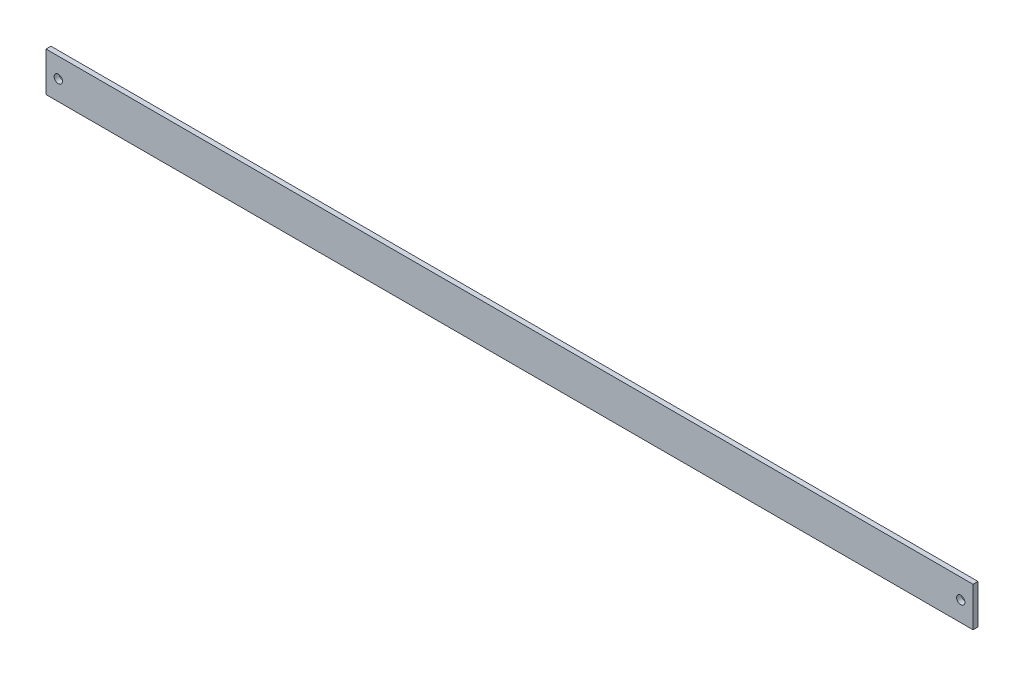
ISO-10303-21;
HEADER;
FILE_DESCRIPTION(('STEP AP214'),'2;1');
FILE_NAME('part.step','',(''),(''),'','','');
FILE_SCHEMA(('AUTOMOTIVE_DESIGN { 1 0 10303 214 1 1 1 1 }'));
ENDSEC;
DATA;
#1=APPLICATION_CONTEXT('core data for automotive mechanical design processes');
#2=APPLICATION_PROTOCOL_DEFINITION('international standard','automotive_design',2000,#1);
#3=PRODUCT_CONTEXT('',#1,'mechanical');
#4=PRODUCT('Part','Part','',(#3));
#5=PRODUCT_RELATED_PRODUCT_CATEGORY('part','',(#4));
#6=PRODUCT_DEFINITION_FORMATION('','',#4);
#7=PRODUCT_DEFINITION_CONTEXT('part definition',#1,'design');
#8=PRODUCT_DEFINITION('design','',#6,#7);
#9=PRODUCT_DEFINITION_SHAPE('','',#8);
#10=(LENGTH_UNIT() NAMED_UNIT(*) SI_UNIT(.MILLI.,.METRE.));
#11=(NAMED_UNIT(*) PLANE_ANGLE_UNIT() SI_UNIT($,.RADIAN.));
#12=(NAMED_UNIT(*) SI_UNIT($,.STERADIAN.) SOLID_ANGLE_UNIT());
#13=UNCERTAINTY_MEASURE_WITH_UNIT(LENGTH_MEASURE(1.E-05),#10,'distance_accuracy_value','');
#14=(GEOMETRIC_REPRESENTATION_CONTEXT(3) GLOBAL_UNCERTAINTY_ASSIGNED_CONTEXT((#13)) GLOBAL_UNIT_ASSIGNED_CONTEXT((#10,
#11,#12)) REPRESENTATION_CONTEXT('',''));
#15=CARTESIAN_POINT('',(0.,0.,0.));
#16=DIRECTION('',(0.,0.,1.));
#17=DIRECTION('',(1.,0.,0.));
#18=AXIS2_PLACEMENT_3D('',#15,#16,#17);
#19=CARTESIAN_POINT('',(596.9,0.,0.));
#20=DIRECTION('',(0.,0.,-1.));
#21=DIRECTION('',(-1.,0.,0.));
#22=AXIS2_PLACEMENT_3D('',#19,#20,#21);
#23=PLANE('',#22);
#24=CARTESIAN_POINT('',(7.93749999999999,12.7,0.));
#25=DIRECTION('',(0.,0.,1.));
#26=DIRECTION('',(1.,0.,0.));
#27=AXIS2_PLACEMENT_3D('',#24,#25,#26);
#28=CIRCLE('',#27,2.667);
#29=CARTESIAN_POINT('',(10.6045,12.7,0.));
#30=VERTEX_POINT('',#29);
#31=EDGE_CURVE('E112',#30,#30,#28,.T.);
#32=ORIENTED_EDGE('',*,*,#31,.F.);
#33=EDGE_LOOP('',(#32));
#34=FACE_BOUND('',#33,.T.);
#35=CARTESIAN_POINT('',(588.9625,12.7,0.));
#36=DIRECTION('',(0.,0.,1.));
#37=DIRECTION('',(1.,0.,0.));
#38=AXIS2_PLACEMENT_3D('',#35,#36,#37);
#39=CIRCLE('',#38,2.66700000000002);
#40=CARTESIAN_POINT('',(591.6295,12.7,0.));
#41=VERTEX_POINT('',#40);
#42=EDGE_CURVE('E113',#41,#41,#39,.T.);
#43=ORIENTED_EDGE('',*,*,#42,.F.);
#44=EDGE_LOOP('',(#43));
#45=FACE_BOUND('',#44,.T.);
#46=DIRECTION('',(0.,-1.,0.));
#47=VECTOR('',#46,1.);
#48=CARTESIAN_POINT('',(0.,0.,0.));
#49=LINE('',#48,#47);
#50=CARTESIAN_POINT('',(0.,25.4,0.));
#51=VERTEX_POINT('',#50);
#52=CARTESIAN_POINT('',(0.,0.,0.));
#53=VERTEX_POINT('',#52);
#54=EDGE_CURVE('E95',#51,#53,#49,.T.);
#55=ORIENTED_EDGE('',*,*,#54,.T.);
#56=DIRECTION('',(-1.,0.,0.));
#57=VECTOR('',#56,1.);
#58=CARTESIAN_POINT('',(596.9,0.,0.));
#59=LINE('',#58,#57);
#60=CARTESIAN_POINT('',(596.9,0.,0.));
#61=VERTEX_POINT('',#60);
#62=EDGE_CURVE('E11',#61,#53,#59,.T.);
#63=ORIENTED_EDGE('',*,*,#62,.F.);
#64=DIRECTION('',(0.,-1.,0.));
#65=VECTOR('',#64,1.);
#66=CARTESIAN_POINT('',(596.9,0.,0.));
#67=LINE('',#66,#65);
#68=CARTESIAN_POINT('',(596.9,25.4,0.));
#69=VERTEX_POINT('',#68);
#70=EDGE_CURVE('E83',#69,#61,#67,.T.);
#71=ORIENTED_EDGE('',*,*,#70,.F.);
#72=DIRECTION('',(-1.,0.,0.));
#73=VECTOR('',#72,1.);
#74=CARTESIAN_POINT('',(596.9,25.4,0.));
#75=LINE('',#74,#73);
#76=EDGE_CURVE('E91',#69,#51,#75,.T.);
#77=ORIENTED_EDGE('',*,*,#76,.T.);
#78=EDGE_LOOP('',(#55,#63,#71,#77));
#79=FACE_BOUND('',#78,.T.);
#80=ADVANCED_FACE('F32',(#34,#45,#79),#23,.F.);
#81=CARTESIAN_POINT('',(596.9,0.,0.));
#82=DIRECTION('',(0.,1.,0.));
#83=DIRECTION('',(0.,0.,1.));
#84=AXIS2_PLACEMENT_3D('',#81,#82,#83);
#85=PLANE('',#84);
#86=DIRECTION('',(0.,0.,-1.));
#87=VECTOR('',#86,1.);
#88=CARTESIAN_POINT('',(0.,0.,0.));
#89=LINE('',#88,#87);
#90=CARTESIAN_POINT('',(0.,0.,-3.175));
#91=VERTEX_POINT('',#90);
#92=EDGE_CURVE('E87',#53,#91,#89,.T.);
#93=ORIENTED_EDGE('',*,*,#92,.T.);
#94=DIRECTION('',(-1.,0.,0.));
#95=VECTOR('',#94,1.);
#96=CARTESIAN_POINT('',(596.9,0.,-3.175));
#97=LINE('',#96,#95);
#98=CARTESIAN_POINT('',(596.9,0.,-3.175));
#99=VERTEX_POINT('',#98);
#100=EDGE_CURVE('E40',#99,#91,#97,.T.);
#101=ORIENTED_EDGE('',*,*,#100,.F.);
#102=DIRECTION('',(0.,0.,-1.));
#103=VECTOR('',#102,1.);
#104=CARTESIAN_POINT('',(596.9,0.,0.));
#105=LINE('',#104,#103);
#106=EDGE_CURVE('E78',#61,#99,#105,.T.);
#107=ORIENTED_EDGE('',*,*,#106,.F.);
#108=ORIENTED_EDGE('',*,*,#62,.T.);
#109=EDGE_LOOP('',(#93,#101,#107,#108));
#110=FACE_BOUND('',#109,.T.);
#111=ADVANCED_FACE('F86',(#110),#85,.F.);
#112=CARTESIAN_POINT('',(596.9,0.,-3.175));
#113=DIRECTION('',(0.,0.,1.));
#114=DIRECTION('',(1.,0.,0.));
#115=AXIS2_PLACEMENT_3D('',#112,#113,#114);
#116=PLANE('',#115);
#117=CARTESIAN_POINT('',(7.93749999999999,12.7,-3.175));
#118=DIRECTION('',(0.,0.,1.));
#119=DIRECTION('',(1.,0.,0.));
#120=AXIS2_PLACEMENT_3D('',#117,#118,#119);
#121=CIRCLE('',#120,2.667);
#122=CARTESIAN_POINT('',(10.6045,12.7,-3.175));
#123=VERTEX_POINT('',#122);
#124=EDGE_CURVE('E98',#123,#123,#121,.F.);
#125=ORIENTED_EDGE('',*,*,#124,.F.);
#126=EDGE_LOOP('',(#125));
#127=FACE_BOUND('',#126,.T.);
#128=CARTESIAN_POINT('',(588.9625,12.7,-3.175));
#129=DIRECTION('',(0.,0.,1.));
#130=DIRECTION('',(1.,0.,0.));
#131=AXIS2_PLACEMENT_3D('',#128,#129,#130);
#132=CIRCLE('',#131,2.66700000000002);
#133=CARTESIAN_POINT('',(591.6295,12.7,-3.175));
#134=VERTEX_POINT('',#133);
#135=EDGE_CURVE('E109',#134,#134,#132,.F.);
#136=ORIENTED_EDGE('',*,*,#135,.F.);
#137=EDGE_LOOP('',(#136));
#138=FACE_BOUND('',#137,.T.);
#139=DIRECTION('',(0.,1.,0.));
#140=VECTOR('',#139,1.);
#141=CARTESIAN_POINT('',(0.,0.,-3.175));
#142=LINE('',#141,#140);
#143=CARTESIAN_POINT('',(0.,25.4,-3.175));
#144=VERTEX_POINT('',#143);
#145=EDGE_CURVE('E65',#91,#144,#142,.T.);
#146=ORIENTED_EDGE('',*,*,#145,.T.);
#147=DIRECTION('',(-1.,0.,0.));
#148=VECTOR('',#147,1.);
#149=CARTESIAN_POINT('',(596.9,25.4,-3.175));
#150=LINE('',#149,#148);
#151=CARTESIAN_POINT('',(596.9,25.4,-3.175));
#152=VERTEX_POINT('',#151);
#153=EDGE_CURVE('E88',#152,#144,#150,.T.);
#154=ORIENTED_EDGE('',*,*,#153,.F.);
#155=DIRECTION('',(0.,1.,0.));
#156=VECTOR('',#155,1.);
#157=CARTESIAN_POINT('',(596.9,0.,-3.175));
#158=LINE('',#157,#156);
#159=EDGE_CURVE('E81',#99,#152,#158,.T.);
#160=ORIENTED_EDGE('',*,*,#159,.F.);
#161=ORIENTED_EDGE('',*,*,#100,.T.);
#162=EDGE_LOOP('',(#146,#154,#160,#161));
#163=FACE_BOUND('',#162,.T.);
#164=ADVANCED_FACE('F89',(#127,#138,#163),#116,.F.);
#165=CARTESIAN_POINT('',(596.9,25.4,0.));
#166=DIRECTION('',(0.,-1.,0.));
#167=DIRECTION('',(0.,0.,-1.));
#168=AXIS2_PLACEMENT_3D('',#165,#166,#167);
#169=PLANE('',#168);
#170=DIRECTION('',(0.,0.,1.));
#171=VECTOR('',#170,1.);
#172=CARTESIAN_POINT('',(0.,25.4,0.));
#173=LINE('',#172,#171);
#174=EDGE_CURVE('E71',#144,#51,#173,.T.);
#175=ORIENTED_EDGE('',*,*,#174,.T.);
#176=ORIENTED_EDGE('',*,*,#76,.F.);
#177=DIRECTION('',(0.,0.,1.));
#178=VECTOR('',#177,1.);
#179=CARTESIAN_POINT('',(596.9,25.4,0.));
#180=LINE('',#179,#178);
#181=EDGE_CURVE('E48',#152,#69,#180,.T.);
#182=ORIENTED_EDGE('',*,*,#181,.F.);
#183=ORIENTED_EDGE('',*,*,#153,.T.);
#184=EDGE_LOOP('',(#175,#176,#182,#183));
#185=FACE_BOUND('',#184,.T.);
#186=ADVANCED_FACE('F103',(#185),#169,.F.);
#187=CARTESIAN_POINT('',(596.9,0.,0.));
#188=DIRECTION('',(-1.,0.,0.));
#189=DIRECTION('',(0.,0.,1.));
#190=AXIS2_PLACEMENT_3D('',#187,#188,#189);
#191=PLANE('',#190);
#192=ORIENTED_EDGE('',*,*,#70,.T.);
#193=ORIENTED_EDGE('',*,*,#106,.T.);
#194=ORIENTED_EDGE('',*,*,#159,.T.);
#195=ORIENTED_EDGE('',*,*,#181,.T.);
#196=EDGE_LOOP('',(#192,#193,#194,#195));
#197=FACE_BOUND('',#196,.T.);
#198=ADVANCED_FACE('F79',(#197),#191,.F.);
#199=CARTESIAN_POINT('',(0.,0.,0.));
#200=DIRECTION('',(-1.,0.,0.));
#201=DIRECTION('',(0.,0.,1.));
#202=AXIS2_PLACEMENT_3D('',#199,#200,#201);
#203=PLANE('',#202);
#204=ORIENTED_EDGE('',*,*,#54,.F.);
#205=ORIENTED_EDGE('',*,*,#174,.F.);
#206=ORIENTED_EDGE('',*,*,#145,.F.);
#207=ORIENTED_EDGE('',*,*,#92,.F.);
#208=EDGE_LOOP('',(#204,#205,#206,#207));
#209=FACE_BOUND('',#208,.T.);
#210=ADVANCED_FACE('F106',(#209),#203,.T.);
#211=CARTESIAN_POINT('',(588.9625,12.7,-3.176));
#212=DIRECTION('',(0.,0.,1.));
#213=DIRECTION('',(1.,0.,0.));
#214=AXIS2_PLACEMENT_3D('',#211,#212,#213);
#215=CYLINDRICAL_SURFACE('',#214,2.66700000000002);
#216=ORIENTED_EDGE('',*,*,#42,.T.);
#217=EDGE_LOOP('',(#216));
#218=FACE_BOUND('',#217,.T.);
#219=ORIENTED_EDGE('',*,*,#135,.T.);
#220=EDGE_LOOP('',(#219));
#221=FACE_BOUND('',#220,.T.);
#222=ADVANCED_FACE('F128',(#218,#221),#215,.F.);
#223=CARTESIAN_POINT('',(7.93749999999999,12.7,-3.176));
#224=DIRECTION('',(0.,0.,1.));
#225=DIRECTION('',(1.,0.,0.));
#226=AXIS2_PLACEMENT_3D('',#223,#224,#225);
#227=CYLINDRICAL_SURFACE('',#226,2.667);
#228=ORIENTED_EDGE('',*,*,#31,.T.);
#229=EDGE_LOOP('',(#228));
#230=FACE_BOUND('',#229,.T.);
#231=ORIENTED_EDGE('',*,*,#124,.T.);
#232=EDGE_LOOP('',(#231));
#233=FACE_BOUND('',#232,.T.);
#234=ADVANCED_FACE('F121',(#230,#233),#227,.F.);
#235=CLOSED_SHELL('',(#80,#111,#164,#186,#198,#210,#222,#234));
#236=MANIFOLD_SOLID_BREP('B2',#235);
#237=ADVANCED_BREP_SHAPE_REPRESENTATION('',(#18,#236),#14);
#238=SHAPE_DEFINITION_REPRESENTATION(#9,#237);
ENDSEC;
END-ISO-10303-21;
